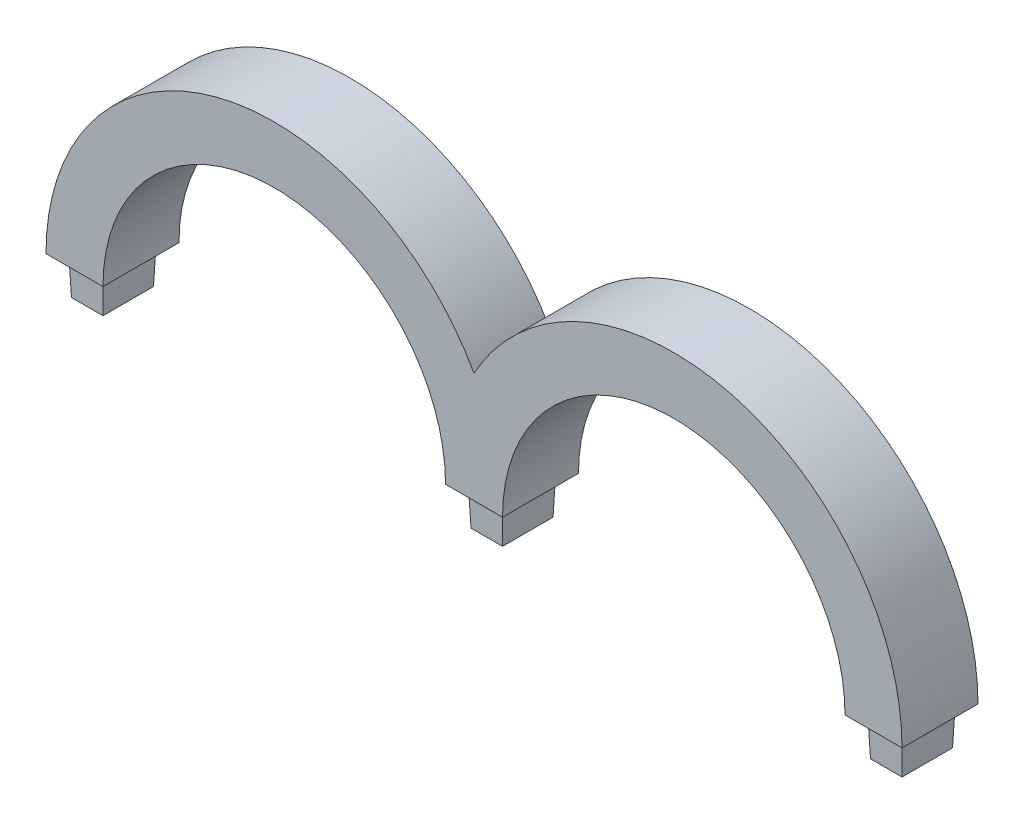
ISO-10303-21;
HEADER;
FILE_DESCRIPTION(('STEP AP214'),'2;1');
FILE_NAME('part.step','',(''),(''),'','','');
FILE_SCHEMA(('AUTOMOTIVE_DESIGN { 1 0 10303 214 1 1 1 1 }'));
ENDSEC;
DATA;
#1=APPLICATION_CONTEXT('core data for automotive mechanical design processes');
#2=APPLICATION_PROTOCOL_DEFINITION('international standard','automotive_design',2000,#1);
#3=PRODUCT_CONTEXT('',#1,'mechanical');
#4=PRODUCT('Part','Part','',(#3));
#5=PRODUCT_RELATED_PRODUCT_CATEGORY('part','',(#4));
#6=PRODUCT_DEFINITION_FORMATION('','',#4);
#7=PRODUCT_DEFINITION_CONTEXT('part definition',#1,'design');
#8=PRODUCT_DEFINITION('design','',#6,#7);
#9=PRODUCT_DEFINITION_SHAPE('','',#8);
#10=(LENGTH_UNIT() NAMED_UNIT(*) SI_UNIT(.MILLI.,.METRE.));
#11=(NAMED_UNIT(*) PLANE_ANGLE_UNIT() SI_UNIT($,.RADIAN.));
#12=(NAMED_UNIT(*) SI_UNIT($,.STERADIAN.) SOLID_ANGLE_UNIT());
#13=UNCERTAINTY_MEASURE_WITH_UNIT(LENGTH_MEASURE(1.E-05),#10,'distance_accuracy_value','');
#14=(GEOMETRIC_REPRESENTATION_CONTEXT(3) GLOBAL_UNCERTAINTY_ASSIGNED_CONTEXT((#13)) GLOBAL_UNIT_ASSIGNED_CONTEXT((#10,
#11,#12)) REPRESENTATION_CONTEXT('',''));
#15=CARTESIAN_POINT('',(0.,0.,0.));
#16=DIRECTION('',(0.,0.,1.));
#17=DIRECTION('',(1.,0.,0.));
#18=AXIS2_PLACEMENT_3D('',#15,#16,#17);
#19=CARTESIAN_POINT('',(-60.085,0.,20.));
#20=DIRECTION('',(0.,1.,0.));
#21=DIRECTION('',(-1.,0.,0.));
#22=AXIS2_PLACEMENT_3D('',#19,#20,#21);
#23=PLANE('',#22);
#24=DIRECTION('',(1.,0.,0.));
#25=VECTOR('',#24,1.);
#26=CARTESIAN_POINT('',(-60.085,0.,0.));
#27=LINE('',#26,#25);
#28=CARTESIAN_POINT('',(-60.085,0.,0.));
#29=VERTEX_POINT('',#28);
#30=CARTESIAN_POINT('',(-45.085,0.,0.));
#31=VERTEX_POINT('',#30);
#32=EDGE_CURVE('E345',#29,#31,#27,.T.);
#33=ORIENTED_EDGE('',*,*,#32,.T.);
#34=DIRECTION('',(0.,0.,-1.));
#35=VECTOR('',#34,1.);
#36=CARTESIAN_POINT('',(-45.085,0.,20.));
#37=LINE('',#36,#35);
#38=CARTESIAN_POINT('',(-45.085,0.,20.));
#39=VERTEX_POINT('',#38);
#40=EDGE_CURVE('E374',#39,#31,#37,.T.);
#41=ORIENTED_EDGE('',*,*,#40,.F.);
#42=DIRECTION('',(1.,0.,0.));
#43=VECTOR('',#42,1.);
#44=CARTESIAN_POINT('',(-60.085,0.,20.));
#45=LINE('',#44,#43);
#46=CARTESIAN_POINT('',(-60.085,0.,20.));
#47=VERTEX_POINT('',#46);
#48=EDGE_CURVE('E323',#47,#39,#45,.T.);
#49=ORIENTED_EDGE('',*,*,#48,.F.);
#50=DIRECTION('',(0.,0.,-1.));
#51=VECTOR('',#50,1.);
#52=CARTESIAN_POINT('',(-60.085,0.,20.));
#53=LINE('',#52,#51);
#54=EDGE_CURVE('E54',#47,#29,#53,.T.);
#55=ORIENTED_EDGE('',*,*,#54,.T.);
#56=EDGE_LOOP('',(#33,#41,#49,#55));
#57=FACE_BOUND('',#56,.T.);
#58=DIRECTION('',(0.,0.,-1.));
#59=VECTOR('',#58,1.);
#60=CARTESIAN_POINT('',(-57.085,0.,17.));
#61=LINE('',#60,#59);
#62=CARTESIAN_POINT('',(-57.085,0.,17.));
#63=VERTEX_POINT('',#62);
#64=CARTESIAN_POINT('',(-57.085,0.,3.));
#65=VERTEX_POINT('',#64);
#66=EDGE_CURVE('E218',#63,#65,#61,.T.);
#67=ORIENTED_EDGE('',*,*,#66,.F.);
#68=DIRECTION('',(-1.,0.,0.));
#69=VECTOR('',#68,1.);
#70=CARTESIAN_POINT('',(-48.085,0.,17.));
#71=LINE('',#70,#69);
#72=CARTESIAN_POINT('',(-48.085,0.,17.));
#73=VERTEX_POINT('',#72);
#74=EDGE_CURVE('E245',#73,#63,#71,.T.);
#75=ORIENTED_EDGE('',*,*,#74,.F.);
#76=DIRECTION('',(0.,0.,1.));
#77=VECTOR('',#76,1.);
#78=CARTESIAN_POINT('',(-48.085,0.,3.));
#79=LINE('',#78,#77);
#80=CARTESIAN_POINT('',(-48.085,0.,3.));
#81=VERTEX_POINT('',#80);
#82=EDGE_CURVE('E66',#81,#73,#79,.T.);
#83=ORIENTED_EDGE('',*,*,#82,.F.);
#84=DIRECTION('',(1.,0.,0.));
#85=VECTOR('',#84,1.);
#86=CARTESIAN_POINT('',(-57.085,0.,3.));
#87=LINE('',#86,#85);
#88=EDGE_CURVE('E61',#65,#81,#87,.T.);
#89=ORIENTED_EDGE('',*,*,#88,.F.);
#90=EDGE_LOOP('',(#67,#75,#83,#89));
#91=FACE_BOUND('',#90,.T.);
#92=ADVANCED_FACE('F45',(#57,#91),#23,.F.);
#93=CARTESIAN_POINT('',(45.085,0.,20.));
#94=DIRECTION('',(0.,1.,0.));
#95=DIRECTION('',(0.,0.,1.));
#96=AXIS2_PLACEMENT_3D('',#93,#94,#95);
#97=PLANE('',#96);
#98=DIRECTION('',(1.,0.,0.));
#99=VECTOR('',#98,1.);
#100=CARTESIAN_POINT('',(45.085,0.,0.));
#101=LINE('',#100,#99);
#102=CARTESIAN_POINT('',(45.085,0.,0.));
#103=VERTEX_POINT('',#102);
#104=CARTESIAN_POINT('',(60.085,0.,0.));
#105=VERTEX_POINT('',#104);
#106=EDGE_CURVE('E351',#103,#105,#101,.T.);
#107=ORIENTED_EDGE('',*,*,#106,.T.);
#108=DIRECTION('',(0.,0.,-1.));
#109=VECTOR('',#108,1.);
#110=CARTESIAN_POINT('',(60.085,0.,20.));
#111=LINE('',#110,#109);
#112=CARTESIAN_POINT('',(60.085,0.,20.));
#113=VERTEX_POINT('',#112);
#114=EDGE_CURVE('E366',#113,#105,#111,.T.);
#115=ORIENTED_EDGE('',*,*,#114,.F.);
#116=DIRECTION('',(1.,0.,0.));
#117=VECTOR('',#116,1.);
#118=CARTESIAN_POINT('',(45.085,0.,20.));
#119=LINE('',#118,#117);
#120=CARTESIAN_POINT('',(45.085,0.,20.));
#121=VERTEX_POINT('',#120);
#122=EDGE_CURVE('E329',#121,#113,#119,.T.);
#123=ORIENTED_EDGE('',*,*,#122,.F.);
#124=DIRECTION('',(0.,0.,-1.));
#125=VECTOR('',#124,1.);
#126=CARTESIAN_POINT('',(45.085,0.,20.));
#127=LINE('',#126,#125);
#128=EDGE_CURVE('E370',#121,#103,#127,.T.);
#129=ORIENTED_EDGE('',*,*,#128,.T.);
#130=EDGE_LOOP('',(#107,#115,#123,#129));
#131=FACE_BOUND('',#130,.T.);
#132=DIRECTION('',(0.,0.,-1.));
#133=VECTOR('',#132,1.);
#134=CARTESIAN_POINT('',(48.085,0.,17.));
#135=LINE('',#134,#133);
#136=CARTESIAN_POINT('',(48.085,0.,17.));
#137=VERTEX_POINT('',#136);
#138=CARTESIAN_POINT('',(48.085,0.,3.));
#139=VERTEX_POINT('',#138);
#140=EDGE_CURVE('E230',#137,#139,#135,.T.);
#141=ORIENTED_EDGE('',*,*,#140,.F.);
#142=DIRECTION('',(-1.,0.,0.));
#143=VECTOR('',#142,1.);
#144=CARTESIAN_POINT('',(57.085,0.,17.));
#145=LINE('',#144,#143);
#146=CARTESIAN_POINT('',(57.085,0.,17.));
#147=VERTEX_POINT('',#146);
#148=EDGE_CURVE('E281',#147,#137,#145,.T.);
#149=ORIENTED_EDGE('',*,*,#148,.F.);
#150=DIRECTION('',(0.,0.,1.));
#151=VECTOR('',#150,1.);
#152=CARTESIAN_POINT('',(57.085,0.,3.));
#153=LINE('',#152,#151);
#154=CARTESIAN_POINT('',(57.085,0.,3.));
#155=VERTEX_POINT('',#154);
#156=EDGE_CURVE('E277',#155,#147,#153,.T.);
#157=ORIENTED_EDGE('',*,*,#156,.F.);
#158=DIRECTION('',(1.,0.,0.));
#159=VECTOR('',#158,1.);
#160=CARTESIAN_POINT('',(48.085,0.,3.));
#161=LINE('',#160,#159);
#162=EDGE_CURVE('E273',#139,#155,#161,.T.);
#163=ORIENTED_EDGE('',*,*,#162,.F.);
#164=EDGE_LOOP('',(#141,#149,#157,#163));
#165=FACE_BOUND('',#164,.T.);
#166=ADVANCED_FACE('F397',(#131,#165),#97,.F.);
#167=CARTESIAN_POINT('',(150.255,0.,20.));
#168=DIRECTION('',(0.,1.,0.));
#169=DIRECTION('',(0.,0.,1.));
#170=AXIS2_PLACEMENT_3D('',#167,#168,#169);
#171=PLANE('',#170);
#172=DIRECTION('',(1.,0.,0.));
#173=VECTOR('',#172,1.);
#174=CARTESIAN_POINT('',(150.255,0.,0.));
#175=LINE('',#174,#173);
#176=CARTESIAN_POINT('',(150.255,0.,0.));
#177=VERTEX_POINT('',#176);
#178=CARTESIAN_POINT('',(165.255,0.,0.));
#179=VERTEX_POINT('',#178);
#180=EDGE_CURVE('E320',#177,#179,#175,.T.);
#181=ORIENTED_EDGE('',*,*,#180,.T.);
#182=DIRECTION('',(0.,0.,-1.));
#183=VECTOR('',#182,1.);
#184=CARTESIAN_POINT('',(165.255,0.,20.));
#185=LINE('',#184,#183);
#186=CARTESIAN_POINT('',(165.255,0.,20.));
#187=VERTEX_POINT('',#186);
#188=EDGE_CURVE('E338',#187,#179,#185,.T.);
#189=ORIENTED_EDGE('',*,*,#188,.F.);
#190=DIRECTION('',(1.,0.,0.));
#191=VECTOR('',#190,1.);
#192=CARTESIAN_POINT('',(150.255,0.,20.));
#193=LINE('',#192,#191);
#194=CARTESIAN_POINT('',(150.255,0.,20.));
#195=VERTEX_POINT('',#194);
#196=EDGE_CURVE('E335',#195,#187,#193,.T.);
#197=ORIENTED_EDGE('',*,*,#196,.F.);
#198=DIRECTION('',(0.,0.,-1.));
#199=VECTOR('',#198,1.);
#200=CARTESIAN_POINT('',(150.255,0.,20.));
#201=LINE('',#200,#199);
#202=EDGE_CURVE('E362',#195,#177,#201,.T.);
#203=ORIENTED_EDGE('',*,*,#202,.T.);
#204=EDGE_LOOP('',(#181,#189,#197,#203));
#205=FACE_BOUND('',#204,.T.);
#206=DIRECTION('',(0.,0.,-1.));
#207=VECTOR('',#206,1.);
#208=CARTESIAN_POINT('',(153.255,0.,17.));
#209=LINE('',#208,#207);
#210=CARTESIAN_POINT('',(153.255,0.,17.));
#211=VERTEX_POINT('',#210);
#212=CARTESIAN_POINT('',(153.255,0.,3.));
#213=VERTEX_POINT('',#212);
#214=EDGE_CURVE('E227',#211,#213,#209,.T.);
#215=ORIENTED_EDGE('',*,*,#214,.F.);
#216=DIRECTION('',(-1.,0.,0.));
#217=VECTOR('',#216,1.);
#218=CARTESIAN_POINT('',(162.255,0.,17.));
#219=LINE('',#218,#217);
#220=CARTESIAN_POINT('',(162.255,0.,17.));
#221=VERTEX_POINT('',#220);
#222=EDGE_CURVE('E192',#221,#211,#219,.T.);
#223=ORIENTED_EDGE('',*,*,#222,.F.);
#224=DIRECTION('',(0.,0.,1.));
#225=VECTOR('',#224,1.);
#226=CARTESIAN_POINT('',(162.255,0.,3.));
#227=LINE('',#226,#225);
#228=CARTESIAN_POINT('',(162.255,0.,3.));
#229=VERTEX_POINT('',#228);
#230=EDGE_CURVE('E206',#229,#221,#227,.T.);
#231=ORIENTED_EDGE('',*,*,#230,.F.);
#232=DIRECTION('',(1.,0.,0.));
#233=VECTOR('',#232,1.);
#234=CARTESIAN_POINT('',(153.255,0.,3.));
#235=LINE('',#234,#233);
#236=EDGE_CURVE('E223',#213,#229,#235,.T.);
#237=ORIENTED_EDGE('',*,*,#236,.F.);
#238=EDGE_LOOP('',(#215,#223,#231,#237));
#239=FACE_BOUND('',#238,.T.);
#240=ADVANCED_FACE('F411',(#205,#239),#171,.F.);
#241=CARTESIAN_POINT('',(105.17,0.,20.));
#242=DIRECTION('',(0.,0.,-1.));
#243=DIRECTION('',(-1.,0.,0.));
#244=AXIS2_PLACEMENT_3D('',#241,#242,#243);
#245=CYLINDRICAL_SURFACE('',#244,60.085);
#246=CARTESIAN_POINT('',(105.17,0.,0.));
#247=DIRECTION('',(0.,0.,1.));
#248=DIRECTION('',(1.,0.,0.));
#249=AXIS2_PLACEMENT_3D('',#246,#247,#248);
#250=CIRCLE('',#249,60.085);
#251=CARTESIAN_POINT('',(52.585,29.0693137173893,0.));
#252=VERTEX_POINT('',#251);
#253=EDGE_CURVE('E290',#179,#252,#250,.T.);
#254=ORIENTED_EDGE('',*,*,#253,.T.);
#255=DIRECTION('',(0.,0.,-1.));
#256=VECTOR('',#255,1.);
#257=CARTESIAN_POINT('',(52.585,29.0693137173893,20.));
#258=LINE('',#257,#256);
#259=CARTESIAN_POINT('',(52.585,29.0693137173893,20.));
#260=VERTEX_POINT('',#259);
#261=EDGE_CURVE('E11',#260,#252,#258,.T.);
#262=ORIENTED_EDGE('',*,*,#261,.F.);
#263=CARTESIAN_POINT('',(105.17,0.,20.));
#264=DIRECTION('',(0.,0.,1.));
#265=DIRECTION('',(1.,0.,0.));
#266=AXIS2_PLACEMENT_3D('',#263,#264,#265);
#267=CIRCLE('',#266,60.085);
#268=EDGE_CURVE('E315',#187,#260,#267,.T.);
#269=ORIENTED_EDGE('',*,*,#268,.F.);
#270=ORIENTED_EDGE('',*,*,#188,.T.);
#271=EDGE_LOOP('',(#254,#262,#269,#270));
#272=FACE_BOUND('',#271,.T.);
#273=ADVANCED_FACE('F47',(#272),#245,.T.);
#274=CARTESIAN_POINT('',(0.,0.,20.));
#275=DIRECTION('',(0.,0.,-1.));
#276=DIRECTION('',(-1.,0.,0.));
#277=AXIS2_PLACEMENT_3D('',#274,#275,#276);
#278=CYLINDRICAL_SURFACE('',#277,60.085);
#279=CARTESIAN_POINT('',(0.,0.,0.));
#280=DIRECTION('',(0.,0.,1.));
#281=DIRECTION('',(1.,0.,0.));
#282=AXIS2_PLACEMENT_3D('',#279,#280,#281);
#283=CIRCLE('',#282,60.085);
#284=EDGE_CURVE('E342',#252,#29,#283,.T.);
#285=ORIENTED_EDGE('',*,*,#284,.T.);
#286=ORIENTED_EDGE('',*,*,#54,.F.);
#287=CARTESIAN_POINT('',(0.,0.,20.));
#288=DIRECTION('',(0.,0.,1.));
#289=DIRECTION('',(1.,0.,0.));
#290=AXIS2_PLACEMENT_3D('',#287,#288,#289);
#291=CIRCLE('',#290,60.085);
#292=EDGE_CURVE('E319',#260,#47,#291,.T.);
#293=ORIENTED_EDGE('',*,*,#292,.F.);
#294=ORIENTED_EDGE('',*,*,#261,.T.);
#295=EDGE_LOOP('',(#285,#286,#293,#294));
#296=FACE_BOUND('',#295,.T.);
#297=ADVANCED_FACE('F406',(#296),#278,.T.);
#298=CARTESIAN_POINT('',(0.,0.,20.));
#299=DIRECTION('',(0.,0.,-1.));
#300=DIRECTION('',(-1.,0.,0.));
#301=AXIS2_PLACEMENT_3D('',#298,#299,#300);
#302=CYLINDRICAL_SURFACE('',#301,45.085);
#303=CARTESIAN_POINT('',(0.,0.,0.));
#304=DIRECTION('',(0.,0.,-1.));
#305=DIRECTION('',(1.,0.,0.));
#306=AXIS2_PLACEMENT_3D('',#303,#304,#305);
#307=CIRCLE('',#306,45.085);
#308=EDGE_CURVE('E348',#31,#103,#307,.T.);
#309=ORIENTED_EDGE('',*,*,#308,.T.);
#310=ORIENTED_EDGE('',*,*,#128,.F.);
#311=CARTESIAN_POINT('',(0.,0.,20.));
#312=DIRECTION('',(0.,0.,-1.));
#313=DIRECTION('',(1.,0.,0.));
#314=AXIS2_PLACEMENT_3D('',#311,#312,#313);
#315=CIRCLE('',#314,45.085);
#316=EDGE_CURVE('E326',#39,#121,#315,.T.);
#317=ORIENTED_EDGE('',*,*,#316,.F.);
#318=ORIENTED_EDGE('',*,*,#40,.T.);
#319=EDGE_LOOP('',(#309,#310,#317,#318));
#320=FACE_BOUND('',#319,.T.);
#321=ADVANCED_FACE('F393',(#320),#302,.F.);
#322=CARTESIAN_POINT('',(105.17,0.,20.));
#323=DIRECTION('',(0.,0.,-1.));
#324=DIRECTION('',(-1.,0.,0.));
#325=AXIS2_PLACEMENT_3D('',#322,#323,#324);
#326=CYLINDRICAL_SURFACE('',#325,45.085);
#327=CARTESIAN_POINT('',(105.17,0.,0.));
#328=DIRECTION('',(0.,0.,-1.));
#329=DIRECTION('',(1.,0.,0.));
#330=AXIS2_PLACEMENT_3D('',#327,#328,#329);
#331=CIRCLE('',#330,45.085);
#332=EDGE_CURVE('E354',#105,#177,#331,.T.);
#333=ORIENTED_EDGE('',*,*,#332,.T.);
#334=ORIENTED_EDGE('',*,*,#202,.F.);
#335=CARTESIAN_POINT('',(105.17,0.,20.));
#336=DIRECTION('',(0.,0.,-1.));
#337=DIRECTION('',(1.,0.,0.));
#338=AXIS2_PLACEMENT_3D('',#335,#336,#337);
#339=CIRCLE('',#338,45.085);
#340=EDGE_CURVE('E332',#113,#195,#339,.T.);
#341=ORIENTED_EDGE('',*,*,#340,.F.);
#342=ORIENTED_EDGE('',*,*,#114,.T.);
#343=EDGE_LOOP('',(#333,#334,#341,#342));
#344=FACE_BOUND('',#343,.T.);
#345=ADVANCED_FACE('F415',(#344),#326,.F.);
#346=CARTESIAN_POINT('',(105.17,0.,20.));
#347=DIRECTION('',(0.,0.,1.));
#348=DIRECTION('',(1.,0.,0.));
#349=AXIS2_PLACEMENT_3D('',#346,#347,#348);
#350=PLANE('',#349);
#351=ORIENTED_EDGE('',*,*,#268,.T.);
#352=ORIENTED_EDGE('',*,*,#292,.T.);
#353=ORIENTED_EDGE('',*,*,#48,.T.);
#354=ORIENTED_EDGE('',*,*,#316,.T.);
#355=ORIENTED_EDGE('',*,*,#122,.T.);
#356=ORIENTED_EDGE('',*,*,#340,.T.);
#357=ORIENTED_EDGE('',*,*,#196,.T.);
#358=EDGE_LOOP('',(#351,#352,#353,#354,#355,#356,#357));
#359=FACE_BOUND('',#358,.T.);
#360=ADVANCED_FACE('F402',(#359),#350,.T.);
#361=CARTESIAN_POINT('',(105.17,0.,0.));
#362=DIRECTION('',(0.,0.,1.));
#363=DIRECTION('',(1.,0.,0.));
#364=AXIS2_PLACEMENT_3D('',#361,#362,#363);
#365=PLANE('',#364);
#366=ORIENTED_EDGE('',*,*,#253,.F.);
#367=ORIENTED_EDGE('',*,*,#180,.F.);
#368=ORIENTED_EDGE('',*,*,#332,.F.);
#369=ORIENTED_EDGE('',*,*,#106,.F.);
#370=ORIENTED_EDGE('',*,*,#308,.F.);
#371=ORIENTED_EDGE('',*,*,#32,.F.);
#372=ORIENTED_EDGE('',*,*,#284,.F.);
#373=EDGE_LOOP('',(#366,#367,#368,#369,#370,#371,#372));
#374=FACE_BOUND('',#373,.T.);
#375=ADVANCED_FACE('F388',(#374),#365,.F.);
#376=CARTESIAN_POINT('',(153.255,0.,17.));
#377=DIRECTION('',(-0.999390827019096,-0.034899496702501,0.));
#378=DIRECTION('',(0.034899496702501,-0.999390827019096,0.));
#379=AXIS2_PLACEMENT_3D('',#376,#377,#378);
#380=PLANE('',#379);
#381=ORIENTED_EDGE('',*,*,#214,.T.);
#382=DIRECTION('',(-0.0348782627423747,0.998782765958718,-0.0348782627423747));
#383=VECTOR('',#382,1.);
#384=CARTESIAN_POINT('',(153.255,0.,3.));
#385=LINE('',#384,#383);
#386=CARTESIAN_POINT('',(153.604207694917,-10.,3.34920769491748));
#387=VERTEX_POINT('',#386);
#388=EDGE_CURVE('E200',#387,#213,#385,.T.);
#389=ORIENTED_EDGE('',*,*,#388,.F.);
#390=DIRECTION('',(0.,0.,1.));
#391=VECTOR('',#390,1.);
#392=CARTESIAN_POINT('',(153.604207694917,-10.,17.));
#393=LINE('',#392,#391);
#394=CARTESIAN_POINT('',(153.604207694917,-10.,16.6507923050825));
#395=VERTEX_POINT('',#394);
#396=EDGE_CURVE('E179',#395,#387,#393,.F.);
#397=ORIENTED_EDGE('',*,*,#396,.F.);
#398=DIRECTION('',(-0.0348782627423747,0.998782765958718,0.0348782627423747));
#399=VECTOR('',#398,1.);
#400=CARTESIAN_POINT('',(153.255,0.,17.));
#401=LINE('',#400,#399);
#402=EDGE_CURVE('E187',#395,#211,#401,.T.);
#403=ORIENTED_EDGE('',*,*,#402,.T.);
#404=EDGE_LOOP('',(#381,#389,#397,#403));
#405=FACE_BOUND('',#404,.T.);
#406=ADVANCED_FACE('F198',(#405),#380,.T.);
#407=CARTESIAN_POINT('',(153.255,0.,3.));
#408=DIRECTION('',(0.,-0.034899496702501,-0.999390827019096));
#409=DIRECTION('',(0.,0.999390827019096,-0.034899496702501));
#410=AXIS2_PLACEMENT_3D('',#407,#408,#409);
#411=PLANE('',#410);
#412=ORIENTED_EDGE('',*,*,#236,.T.);
#413=DIRECTION('',(0.0348782627423747,0.998782765958718,-0.0348782627423747));
#414=VECTOR('',#413,1.);
#415=CARTESIAN_POINT('',(162.255,0.,3.));
#416=LINE('',#415,#414);
#417=CARTESIAN_POINT('',(161.905792305082,-10.,3.34920769491748));
#418=VERTEX_POINT('',#417);
#419=EDGE_CURVE('E211',#418,#229,#416,.T.);
#420=ORIENTED_EDGE('',*,*,#419,.F.);
#421=DIRECTION('',(-1.,0.,0.));
#422=VECTOR('',#421,1.);
#423=CARTESIAN_POINT('',(153.255,-10.,3.34920769491748));
#424=LINE('',#423,#422);
#425=EDGE_CURVE('E202',#387,#418,#424,.F.);
#426=ORIENTED_EDGE('',*,*,#425,.F.);
#427=ORIENTED_EDGE('',*,*,#388,.T.);
#428=EDGE_LOOP('',(#412,#420,#426,#427));
#429=FACE_BOUND('',#428,.T.);
#430=ADVANCED_FACE('F487',(#429),#411,.T.);
#431=CARTESIAN_POINT('',(162.255,0.,3.));
#432=DIRECTION('',(0.999390827019096,-0.034899496702501,0.));
#433=DIRECTION('',(0.034899496702501,0.999390827019096,0.));
#434=AXIS2_PLACEMENT_3D('',#431,#432,#433);
#435=PLANE('',#434);
#436=ORIENTED_EDGE('',*,*,#230,.T.);
#437=DIRECTION('',(0.0348782627423747,0.998782765958718,0.0348782627423747));
#438=VECTOR('',#437,1.);
#439=CARTESIAN_POINT('',(162.255,0.,17.));
#440=LINE('',#439,#438);
#441=CARTESIAN_POINT('',(161.905792305082,-10.,16.6507923050825));
#442=VERTEX_POINT('',#441);
#443=EDGE_CURVE('E196',#442,#221,#440,.T.);
#444=ORIENTED_EDGE('',*,*,#443,.F.);
#445=DIRECTION('',(0.,0.,-1.));
#446=VECTOR('',#445,1.);
#447=CARTESIAN_POINT('',(161.905792305082,-10.,3.));
#448=LINE('',#447,#446);
#449=EDGE_CURVE('E182',#418,#442,#448,.F.);
#450=ORIENTED_EDGE('',*,*,#449,.F.);
#451=ORIENTED_EDGE('',*,*,#419,.T.);
#452=EDGE_LOOP('',(#436,#444,#450,#451));
#453=FACE_BOUND('',#452,.T.);
#454=ADVANCED_FACE('F490',(#453),#435,.T.);
#455=CARTESIAN_POINT('',(162.255,0.,17.));
#456=DIRECTION('',(0.,-0.034899496702501,0.999390827019096));
#457=DIRECTION('',(0.,-0.999390827019096,-0.034899496702501));
#458=AXIS2_PLACEMENT_3D('',#455,#456,#457);
#459=PLANE('',#458);
#460=ORIENTED_EDGE('',*,*,#222,.T.);
#461=ORIENTED_EDGE('',*,*,#402,.F.);
#462=DIRECTION('',(1.,0.,0.));
#463=VECTOR('',#462,1.);
#464=CARTESIAN_POINT('',(162.255,-10.,16.6507923050825));
#465=LINE('',#464,#463);
#466=EDGE_CURVE('E175',#442,#395,#465,.F.);
#467=ORIENTED_EDGE('',*,*,#466,.F.);
#468=ORIENTED_EDGE('',*,*,#443,.T.);
#469=EDGE_LOOP('',(#460,#461,#467,#468));
#470=FACE_BOUND('',#469,.T.);
#471=ADVANCED_FACE('F191',(#470),#459,.T.);
#472=CARTESIAN_POINT('',(0.,-10.,0.));
#473=DIRECTION('',(0.,-1.,0.));
#474=DIRECTION('',(0.,0.,-1.));
#475=AXIS2_PLACEMENT_3D('',#472,#473,#474);
#476=PLANE('',#475);
#477=ORIENTED_EDGE('',*,*,#396,.T.);
#478=ORIENTED_EDGE('',*,*,#425,.T.);
#479=ORIENTED_EDGE('',*,*,#449,.T.);
#480=ORIENTED_EDGE('',*,*,#466,.T.);
#481=EDGE_LOOP('',(#477,#478,#479,#480));
#482=FACE_BOUND('',#481,.T.);
#483=ADVANCED_FACE('F177',(#482),#476,.T.);
#484=CARTESIAN_POINT('',(48.085,0.,17.));
#485=DIRECTION('',(-0.999390827019096,-0.034899496702501,0.));
#486=DIRECTION('',(0.034899496702501,-0.999390827019096,0.));
#487=AXIS2_PLACEMENT_3D('',#484,#485,#486);
#488=PLANE('',#487);
#489=ORIENTED_EDGE('',*,*,#140,.T.);
#490=DIRECTION('',(-0.0348782627423747,0.998782765958718,-0.0348782627423747));
#491=VECTOR('',#490,1.);
#492=CARTESIAN_POINT('',(48.085,0.,3.));
#493=LINE('',#492,#491);
#494=CARTESIAN_POINT('',(48.4342076949175,-10.,3.34920769491748));
#495=VERTEX_POINT('',#494);
#496=EDGE_CURVE('E286',#495,#139,#493,.T.);
#497=ORIENTED_EDGE('',*,*,#496,.F.);
#498=DIRECTION('',(0.,0.,1.));
#499=VECTOR('',#498,1.);
#500=CARTESIAN_POINT('',(48.4342076949175,-10.,17.));
#501=LINE('',#500,#499);
#502=CARTESIAN_POINT('',(48.4342076949175,-10.,16.6507923050825));
#503=VERTEX_POINT('',#502);
#504=EDGE_CURVE('E285',#503,#495,#501,.F.);
#505=ORIENTED_EDGE('',*,*,#504,.F.);
#506=DIRECTION('',(-0.0348782627423747,0.998782765958718,0.0348782627423747));
#507=VECTOR('',#506,1.);
#508=CARTESIAN_POINT('',(48.085,0.,17.));
#509=LINE('',#508,#507);
#510=EDGE_CURVE('E292',#503,#137,#509,.T.);
#511=ORIENTED_EDGE('',*,*,#510,.T.);
#512=EDGE_LOOP('',(#489,#497,#505,#511));
#513=FACE_BOUND('',#512,.T.);
#514=ADVANCED_FACE('F448',(#513),#488,.T.);
#515=CARTESIAN_POINT('',(48.085,0.,3.));
#516=DIRECTION('',(0.,-0.034899496702501,-0.999390827019096));
#517=DIRECTION('',(0.,0.999390827019096,-0.034899496702501));
#518=AXIS2_PLACEMENT_3D('',#515,#516,#517);
#519=PLANE('',#518);
#520=ORIENTED_EDGE('',*,*,#162,.T.);
#521=DIRECTION('',(0.0348782627423747,0.998782765958718,-0.0348782627423747));
#522=VECTOR('',#521,1.);
#523=CARTESIAN_POINT('',(57.085,0.,3.));
#524=LINE('',#523,#522);
#525=CARTESIAN_POINT('',(56.7357923050825,-10.,3.34920769491748));
#526=VERTEX_POINT('',#525);
#527=EDGE_CURVE('E291',#526,#155,#524,.T.);
#528=ORIENTED_EDGE('',*,*,#527,.F.);
#529=DIRECTION('',(-1.,0.,0.));
#530=VECTOR('',#529,1.);
#531=CARTESIAN_POINT('',(48.085,-10.,3.34920769491748));
#532=LINE('',#531,#530);
#533=EDGE_CURVE('E307',#495,#526,#532,.F.);
#534=ORIENTED_EDGE('',*,*,#533,.F.);
#535=ORIENTED_EDGE('',*,*,#496,.T.);
#536=EDGE_LOOP('',(#520,#528,#534,#535));
#537=FACE_BOUND('',#536,.T.);
#538=ADVANCED_FACE('F444',(#537),#519,.T.);
#539=CARTESIAN_POINT('',(57.085,0.,3.));
#540=DIRECTION('',(0.999390827019096,-0.034899496702501,0.));
#541=DIRECTION('',(0.034899496702501,0.999390827019096,0.));
#542=AXIS2_PLACEMENT_3D('',#539,#540,#541);
#543=PLANE('',#542);
#544=ORIENTED_EDGE('',*,*,#156,.T.);
#545=DIRECTION('',(0.0348782627423747,0.998782765958718,0.0348782627423747));
#546=VECTOR('',#545,1.);
#547=CARTESIAN_POINT('',(57.085,0.,17.));
#548=LINE('',#547,#546);
#549=CARTESIAN_POINT('',(56.7357923050825,-10.,16.6507923050825));
#550=VERTEX_POINT('',#549);
#551=EDGE_CURVE('E296',#550,#147,#548,.T.);
#552=ORIENTED_EDGE('',*,*,#551,.F.);
#553=DIRECTION('',(0.,0.,-1.));
#554=VECTOR('',#553,1.);
#555=CARTESIAN_POINT('',(56.7357923050825,-10.,3.));
#556=LINE('',#555,#554);
#557=EDGE_CURVE('E310',#526,#550,#556,.F.);
#558=ORIENTED_EDGE('',*,*,#557,.F.);
#559=ORIENTED_EDGE('',*,*,#527,.T.);
#560=EDGE_LOOP('',(#544,#552,#558,#559));
#561=FACE_BOUND('',#560,.T.);
#562=ADVANCED_FACE('F447',(#561),#543,.T.);
#563=CARTESIAN_POINT('',(57.085,0.,17.));
#564=DIRECTION('',(0.,-0.034899496702501,0.999390827019096));
#565=DIRECTION('',(0.,-0.999390827019096,-0.034899496702501));
#566=AXIS2_PLACEMENT_3D('',#563,#564,#565);
#567=PLANE('',#566);
#568=ORIENTED_EDGE('',*,*,#148,.T.);
#569=ORIENTED_EDGE('',*,*,#510,.F.);
#570=DIRECTION('',(1.,0.,0.));
#571=VECTOR('',#570,1.);
#572=CARTESIAN_POINT('',(57.085,-10.,16.6507923050825));
#573=LINE('',#572,#571);
#574=EDGE_CURVE('E297',#550,#503,#573,.F.);
#575=ORIENTED_EDGE('',*,*,#574,.F.);
#576=ORIENTED_EDGE('',*,*,#551,.T.);
#577=EDGE_LOOP('',(#568,#569,#575,#576));
#578=FACE_BOUND('',#577,.T.);
#579=ADVANCED_FACE('F452',(#578),#567,.T.);
#580=CARTESIAN_POINT('',(0.,-10.,0.));
#581=DIRECTION('',(0.,-1.,0.));
#582=DIRECTION('',(0.,0.,-1.));
#583=AXIS2_PLACEMENT_3D('',#580,#581,#582);
#584=PLANE('',#583);
#585=ORIENTED_EDGE('',*,*,#504,.T.);
#586=ORIENTED_EDGE('',*,*,#533,.T.);
#587=ORIENTED_EDGE('',*,*,#557,.T.);
#588=ORIENTED_EDGE('',*,*,#574,.T.);
#589=EDGE_LOOP('',(#585,#586,#587,#588));
#590=FACE_BOUND('',#589,.T.);
#591=ADVANCED_FACE('F456',(#590),#584,.T.);
#592=CARTESIAN_POINT('',(-57.085,0.,17.));
#593=DIRECTION('',(-0.999390827019096,-0.034899496702501,0.));
#594=DIRECTION('',(0.034899496702501,-0.999390827019096,0.));
#595=AXIS2_PLACEMENT_3D('',#592,#593,#594);
#596=PLANE('',#595);
#597=ORIENTED_EDGE('',*,*,#66,.T.);
#598=DIRECTION('',(-0.0348782627423747,0.998782765958718,-0.0348782627423747));
#599=VECTOR('',#598,1.);
#600=CARTESIAN_POINT('',(-57.085,0.,3.));
#601=LINE('',#600,#599);
#602=CARTESIAN_POINT('',(-56.7357923050825,-10.,3.34920769491748));
#603=VERTEX_POINT('',#602);
#604=EDGE_CURVE('E251',#603,#65,#601,.T.);
#605=ORIENTED_EDGE('',*,*,#604,.F.);
#606=DIRECTION('',(0.,0.,1.));
#607=VECTOR('',#606,1.);
#608=CARTESIAN_POINT('',(-56.7357923050825,-10.,17.));
#609=LINE('',#608,#607);
#610=CARTESIAN_POINT('',(-56.7357923050825,-10.,16.6507923050825));
#611=VERTEX_POINT('',#610);
#612=EDGE_CURVE('E241',#611,#603,#609,.F.);
#613=ORIENTED_EDGE('',*,*,#612,.F.);
#614=DIRECTION('',(-0.0348782627423747,0.998782765958718,0.0348782627423747));
#615=VECTOR('',#614,1.);
#616=CARTESIAN_POINT('',(-57.085,0.,17.));
#617=LINE('',#616,#615);
#618=EDGE_CURVE('E235',#611,#63,#617,.T.);
#619=ORIENTED_EDGE('',*,*,#618,.T.);
#620=EDGE_LOOP('',(#597,#605,#613,#619));
#621=FACE_BOUND('',#620,.T.);
#622=ADVANCED_FACE('F463',(#621),#596,.T.);
#623=CARTESIAN_POINT('',(-57.085,0.,3.));
#624=DIRECTION('',(0.,-0.034899496702501,-0.999390827019096));
#625=DIRECTION('',(0.,0.999390827019096,-0.034899496702501));
#626=AXIS2_PLACEMENT_3D('',#623,#624,#625);
#627=PLANE('',#626);
#628=ORIENTED_EDGE('',*,*,#88,.T.);
#629=DIRECTION('',(0.0348782627423747,0.998782765958718,-0.0348782627423747));
#630=VECTOR('',#629,1.);
#631=CARTESIAN_POINT('',(-48.085,0.,3.));
#632=LINE('',#631,#630);
#633=CARTESIAN_POINT('',(-48.4342076949175,-10.,3.34920769491748));
#634=VERTEX_POINT('',#633);
#635=EDGE_CURVE('E246',#634,#81,#632,.T.);
#636=ORIENTED_EDGE('',*,*,#635,.F.);
#637=DIRECTION('',(-1.,0.,0.));
#638=VECTOR('',#637,1.);
#639=CARTESIAN_POINT('',(-57.085,-10.,3.34920769491748));
#640=LINE('',#639,#638);
#641=EDGE_CURVE('E238',#603,#634,#640,.F.);
#642=ORIENTED_EDGE('',*,*,#641,.F.);
#643=ORIENTED_EDGE('',*,*,#604,.T.);
#644=EDGE_LOOP('',(#628,#636,#642,#643));
#645=FACE_BOUND('',#644,.T.);
#646=ADVANCED_FACE('F472',(#645),#627,.T.);
#647=CARTESIAN_POINT('',(-48.085,0.,3.));
#648=DIRECTION('',(0.999390827019096,-0.034899496702501,0.));
#649=DIRECTION('',(0.034899496702501,0.999390827019096,0.));
#650=AXIS2_PLACEMENT_3D('',#647,#648,#649);
#651=PLANE('',#650);
#652=ORIENTED_EDGE('',*,*,#82,.T.);
#653=DIRECTION('',(0.0348782627423747,0.998782765958718,0.0348782627423747));
#654=VECTOR('',#653,1.);
#655=CARTESIAN_POINT('',(-48.085,0.,17.));
#656=LINE('',#655,#654);
#657=CARTESIAN_POINT('',(-48.4342076949175,-10.,16.6507923050825));
#658=VERTEX_POINT('',#657);
#659=EDGE_CURVE('E250',#658,#73,#656,.T.);
#660=ORIENTED_EDGE('',*,*,#659,.F.);
#661=DIRECTION('',(0.,0.,-1.));
#662=VECTOR('',#661,1.);
#663=CARTESIAN_POINT('',(-48.4342076949175,-10.,3.));
#664=LINE('',#663,#662);
#665=EDGE_CURVE('E234',#634,#658,#664,.F.);
#666=ORIENTED_EDGE('',*,*,#665,.F.);
#667=ORIENTED_EDGE('',*,*,#635,.T.);
#668=EDGE_LOOP('',(#652,#660,#666,#667));
#669=FACE_BOUND('',#668,.T.);
#670=ADVANCED_FACE('F476',(#669),#651,.T.);
#671=CARTESIAN_POINT('',(-48.085,0.,17.));
#672=DIRECTION('',(0.,-0.034899496702501,0.999390827019096));
#673=DIRECTION('',(0.,-0.999390827019096,-0.034899496702501));
#674=AXIS2_PLACEMENT_3D('',#671,#672,#673);
#675=PLANE('',#674);
#676=ORIENTED_EDGE('',*,*,#74,.T.);
#677=ORIENTED_EDGE('',*,*,#618,.F.);
#678=DIRECTION('',(1.,0.,0.));
#679=VECTOR('',#678,1.);
#680=CARTESIAN_POINT('',(-48.085,-10.,16.6507923050825));
#681=LINE('',#680,#679);
#682=EDGE_CURVE('E231',#658,#611,#681,.F.);
#683=ORIENTED_EDGE('',*,*,#682,.F.);
#684=ORIENTED_EDGE('',*,*,#659,.T.);
#685=EDGE_LOOP('',(#676,#677,#683,#684));
#686=FACE_BOUND('',#685,.T.);
#687=ADVANCED_FACE('F468',(#686),#675,.T.);
#688=CARTESIAN_POINT('',(0.,-10.,0.));
#689=DIRECTION('',(0.,-1.,0.));
#690=DIRECTION('',(0.,0.,-1.));
#691=AXIS2_PLACEMENT_3D('',#688,#689,#690);
#692=PLANE('',#691);
#693=ORIENTED_EDGE('',*,*,#612,.T.);
#694=ORIENTED_EDGE('',*,*,#641,.T.);
#695=ORIENTED_EDGE('',*,*,#665,.T.);
#696=ORIENTED_EDGE('',*,*,#682,.T.);
#697=EDGE_LOOP('',(#693,#694,#695,#696));
#698=FACE_BOUND('',#697,.T.);
#699=ADVANCED_FACE('F465',(#698),#692,.T.);
#700=CLOSED_SHELL('',(#92,#166,#240,#273,#297,#321,#345,#360,#375,#406,#430,#454,#471,#483,#514,
#538,#562,#579,#591,#622,#646,#670,#687,#699));
#701=MANIFOLD_SOLID_BREP('B2',#700);
#702=ADVANCED_BREP_SHAPE_REPRESENTATION('',(#18,#701),#14);
#703=SHAPE_DEFINITION_REPRESENTATION(#9,#702);
ENDSEC;
END-ISO-10303-21;
